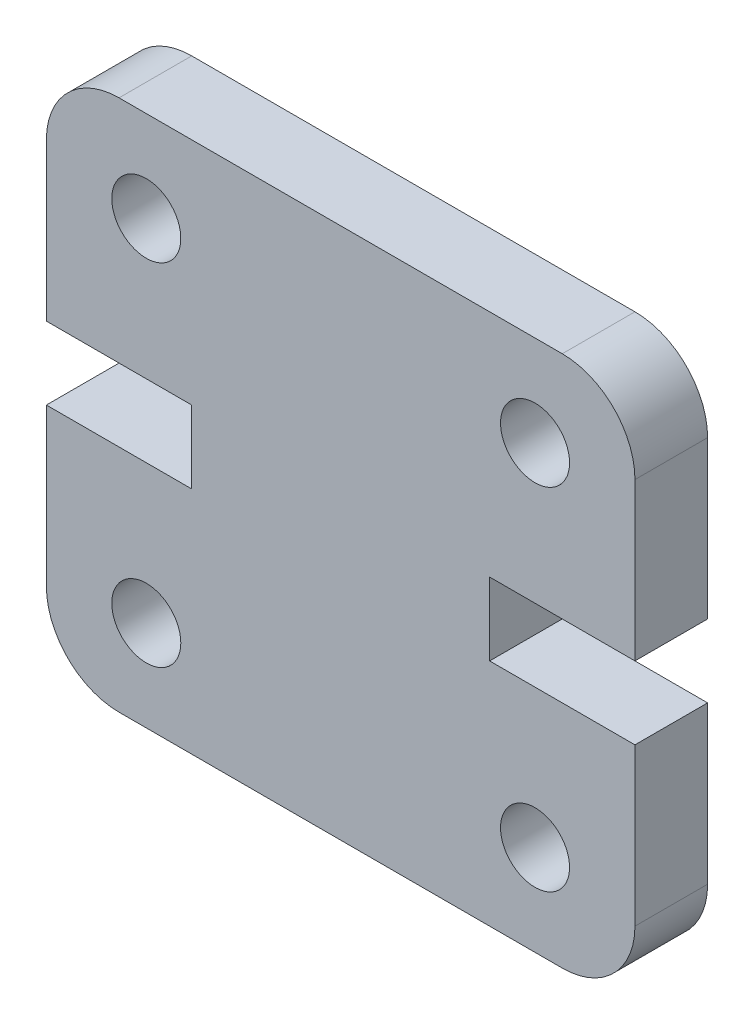
ISO-10303-21;
HEADER;
FILE_DESCRIPTION(('STEP AP214'),'2;1');
FILE_NAME('part.step','',(''),(''),'','','');
FILE_SCHEMA(('AUTOMOTIVE_DESIGN { 1 0 10303 214 1 1 1 1 }'));
ENDSEC;
DATA;
#1=APPLICATION_CONTEXT('core data for automotive mechanical design processes');
#2=APPLICATION_PROTOCOL_DEFINITION('international standard','automotive_design',2000,#1);
#3=PRODUCT_CONTEXT('',#1,'mechanical');
#4=PRODUCT('Part','Part','',(#3));
#5=PRODUCT_RELATED_PRODUCT_CATEGORY('part','',(#4));
#6=PRODUCT_DEFINITION_FORMATION('','',#4);
#7=PRODUCT_DEFINITION_CONTEXT('part definition',#1,'design');
#8=PRODUCT_DEFINITION('design','',#6,#7);
#9=PRODUCT_DEFINITION_SHAPE('','',#8);
#10=(LENGTH_UNIT() NAMED_UNIT(*) SI_UNIT(.MILLI.,.METRE.));
#11=(NAMED_UNIT(*) PLANE_ANGLE_UNIT() SI_UNIT($,.RADIAN.));
#12=(NAMED_UNIT(*) SI_UNIT($,.STERADIAN.) SOLID_ANGLE_UNIT());
#13=UNCERTAINTY_MEASURE_WITH_UNIT(LENGTH_MEASURE(1.E-05),#10,'distance_accuracy_value','');
#14=(GEOMETRIC_REPRESENTATION_CONTEXT(3) GLOBAL_UNCERTAINTY_ASSIGNED_CONTEXT((#13)) GLOBAL_UNIT_ASSIGNED_CONTEXT((#10,
#11,#12)) REPRESENTATION_CONTEXT('',''));
#15=CARTESIAN_POINT('',(0.,0.,0.));
#16=DIRECTION('',(0.,0.,1.));
#17=DIRECTION('',(1.,0.,0.));
#18=AXIS2_PLACEMENT_3D('',#15,#16,#17);
#19=CARTESIAN_POINT('',(2.,12.645,4.));
#20=DIRECTION('',(0.,0.,-1.));
#21=DIRECTION('',(-1.,0.,0.));
#22=AXIS2_PLACEMENT_3D('',#19,#20,#21);
#23=PLANE('',#22);
#24=CARTESIAN_POINT('',(13.4499999999986,12.1450000000001,4.));
#25=DIRECTION('',(0.,0.,1.));
#26=DIRECTION('',(1.,0.,0.));
#27=AXIS2_PLACEMENT_3D('',#24,#25,#26);
#28=CIRCLE('',#27,0.949999999999999);
#29=CARTESIAN_POINT('',(14.3999999999986,12.1450000000001,4.));
#30=VERTEX_POINT('',#29);
#31=EDGE_CURVE('E239',#30,#30,#28,.T.);
#32=ORIENTED_EDGE('',*,*,#31,.F.);
#33=EDGE_LOOP('',(#32));
#34=FACE_BOUND('',#33,.T.);
#35=CARTESIAN_POINT('',(2.75000000000139,12.1450000000001,4.));
#36=DIRECTION('',(0.,0.,1.));
#37=DIRECTION('',(-1.,0.,0.));
#38=AXIS2_PLACEMENT_3D('',#35,#36,#37);
#39=CIRCLE('',#38,0.95);
#40=CARTESIAN_POINT('',(1.80000000000139,12.1450000000001,4.));
#41=VERTEX_POINT('',#40);
#42=EDGE_CURVE('E245',#41,#41,#39,.T.);
#43=ORIENTED_EDGE('',*,*,#42,.F.);
#44=EDGE_LOOP('',(#43));
#45=FACE_BOUND('',#44,.T.);
#46=CARTESIAN_POINT('',(2.,12.645,4.));
#47=DIRECTION('',(0.,0.,1.));
#48=DIRECTION('',(-1.,0.,0.));
#49=AXIS2_PLACEMENT_3D('',#46,#47,#48);
#50=CIRCLE('',#49,2.);
#51=CARTESIAN_POINT('',(2.,14.645,4.));
#52=VERTEX_POINT('',#51);
#53=CARTESIAN_POINT('',(0.,12.645,4.));
#54=VERTEX_POINT('',#53);
#55=EDGE_CURVE('E248',#52,#54,#50,.T.);
#56=ORIENTED_EDGE('',*,*,#55,.T.);
#57=DIRECTION('',(0.,-1.,0.));
#58=VECTOR('',#57,1.);
#59=CARTESIAN_POINT('',(0.,8.3225,4.));
#60=LINE('',#59,#58);
#61=CARTESIAN_POINT('',(0.,8.3225,4.));
#62=VERTEX_POINT('',#61);
#63=EDGE_CURVE('E199',#54,#62,#60,.T.);
#64=ORIENTED_EDGE('',*,*,#63,.T.);
#65=DIRECTION('',(1.,0.,0.));
#66=VECTOR('',#65,1.);
#67=CARTESIAN_POINT('',(0.,8.3225,4.));
#68=LINE('',#67,#66);
#69=CARTESIAN_POINT('',(4.,8.3225,4.));
#70=VERTEX_POINT('',#69);
#71=EDGE_CURVE('E195',#62,#70,#68,.T.);
#72=ORIENTED_EDGE('',*,*,#71,.T.);
#73=DIRECTION('',(0.,-1.,0.));
#74=VECTOR('',#73,1.);
#75=CARTESIAN_POINT('',(4.,6.3225,4.));
#76=LINE('',#75,#74);
#77=CARTESIAN_POINT('',(4.,6.3225,4.));
#78=VERTEX_POINT('',#77);
#79=EDGE_CURVE('E252',#70,#78,#76,.T.);
#80=ORIENTED_EDGE('',*,*,#79,.T.);
#81=DIRECTION('',(-1.,0.,0.));
#82=VECTOR('',#81,1.);
#83=CARTESIAN_POINT('',(0.,6.3225,4.));
#84=LINE('',#83,#82);
#85=CARTESIAN_POINT('',(0.,6.3225,4.));
#86=VERTEX_POINT('',#85);
#87=EDGE_CURVE('E254',#78,#86,#84,.T.);
#88=ORIENTED_EDGE('',*,*,#87,.T.);
#89=DIRECTION('',(0.,-1.,0.));
#90=VECTOR('',#89,1.);
#91=CARTESIAN_POINT('',(0.,6.3225,4.));
#92=LINE('',#91,#90);
#93=CARTESIAN_POINT('',(0.,2.00000000000003,4.));
#94=VERTEX_POINT('',#93);
#95=EDGE_CURVE('E256',#86,#94,#92,.T.);
#96=ORIENTED_EDGE('',*,*,#95,.T.);
#97=CARTESIAN_POINT('',(2.,2.,4.));
#98=DIRECTION('',(0.,0.,1.));
#99=DIRECTION('',(1.,0.,0.));
#100=AXIS2_PLACEMENT_3D('',#97,#98,#99);
#101=CIRCLE('',#100,2.);
#102=CARTESIAN_POINT('',(2.,0.,4.));
#103=VERTEX_POINT('',#102);
#104=EDGE_CURVE('E173',#94,#103,#101,.T.);
#105=ORIENTED_EDGE('',*,*,#104,.T.);
#106=DIRECTION('',(1.,0.,0.));
#107=VECTOR('',#106,1.);
#108=CARTESIAN_POINT('',(2.,0.,4.));
#109=LINE('',#108,#107);
#110=CARTESIAN_POINT('',(14.2,0.,4.));
#111=VERTEX_POINT('',#110);
#112=EDGE_CURVE('E259',#103,#111,#109,.T.);
#113=ORIENTED_EDGE('',*,*,#112,.T.);
#114=CARTESIAN_POINT('',(14.2,2.,4.));
#115=DIRECTION('',(0.,0.,1.));
#116=DIRECTION('',(-1.,0.,0.));
#117=AXIS2_PLACEMENT_3D('',#114,#115,#116);
#118=CIRCLE('',#117,2.);
#119=CARTESIAN_POINT('',(16.2,2.00000000000003,4.));
#120=VERTEX_POINT('',#119);
#121=EDGE_CURVE('E261',#111,#120,#118,.T.);
#122=ORIENTED_EDGE('',*,*,#121,.T.);
#123=DIRECTION('',(0.,1.,0.));
#124=VECTOR('',#123,1.);
#125=CARTESIAN_POINT('',(16.2,6.3225,4.));
#126=LINE('',#125,#124);
#127=CARTESIAN_POINT('',(16.2,6.3225,4.));
#128=VERTEX_POINT('',#127);
#129=EDGE_CURVE('E263',#120,#128,#126,.T.);
#130=ORIENTED_EDGE('',*,*,#129,.T.);
#131=DIRECTION('',(-1.,0.,0.));
#132=VECTOR('',#131,1.);
#133=CARTESIAN_POINT('',(16.2,6.3225,4.));
#134=LINE('',#133,#132);
#135=CARTESIAN_POINT('',(12.2,6.3225,4.));
#136=VERTEX_POINT('',#135);
#137=EDGE_CURVE('E265',#128,#136,#134,.T.);
#138=ORIENTED_EDGE('',*,*,#137,.T.);
#139=DIRECTION('',(0.,1.,0.));
#140=VECTOR('',#139,1.);
#141=CARTESIAN_POINT('',(12.2,6.3225,4.));
#142=LINE('',#141,#140);
#143=CARTESIAN_POINT('',(12.2,8.3225,4.));
#144=VERTEX_POINT('',#143);
#145=EDGE_CURVE('E267',#136,#144,#142,.T.);
#146=ORIENTED_EDGE('',*,*,#145,.T.);
#147=DIRECTION('',(1.,0.,0.));
#148=VECTOR('',#147,1.);
#149=CARTESIAN_POINT('',(16.2,8.3225,4.));
#150=LINE('',#149,#148);
#151=CARTESIAN_POINT('',(16.2,8.3225,4.));
#152=VERTEX_POINT('',#151);
#153=EDGE_CURVE('E269',#144,#152,#150,.T.);
#154=ORIENTED_EDGE('',*,*,#153,.T.);
#155=DIRECTION('',(0.,1.,0.));
#156=VECTOR('',#155,1.);
#157=CARTESIAN_POINT('',(16.2,8.3225,4.));
#158=LINE('',#157,#156);
#159=CARTESIAN_POINT('',(16.2,12.645,4.));
#160=VERTEX_POINT('',#159);
#161=EDGE_CURVE('E271',#152,#160,#158,.T.);
#162=ORIENTED_EDGE('',*,*,#161,.T.);
#163=CARTESIAN_POINT('',(14.2,12.645,4.));
#164=DIRECTION('',(0.,0.,1.));
#165=DIRECTION('',(1.,0.,0.));
#166=AXIS2_PLACEMENT_3D('',#163,#164,#165);
#167=CIRCLE('',#166,2.);
#168=CARTESIAN_POINT('',(14.2,14.645,4.));
#169=VERTEX_POINT('',#168);
#170=EDGE_CURVE('E273',#160,#169,#167,.T.);
#171=ORIENTED_EDGE('',*,*,#170,.T.);
#172=DIRECTION('',(-1.,0.,0.));
#173=VECTOR('',#172,1.);
#174=CARTESIAN_POINT('',(2.,14.645,4.));
#175=LINE('',#174,#173);
#176=EDGE_CURVE('E57',#169,#52,#175,.T.);
#177=ORIENTED_EDGE('',*,*,#176,.T.);
#178=EDGE_LOOP('',(#56,#64,#72,#80,#88,#96,#105,#113,#122,#130,#138,#146,#154,#162,#171,#177));
#179=FACE_BOUND('',#178,.T.);
#180=CARTESIAN_POINT('',(13.4499999999986,2.4999999999999,4.));
#181=DIRECTION('',(0.,0.,1.));
#182=DIRECTION('',(-1.,0.,0.));
#183=AXIS2_PLACEMENT_3D('',#180,#181,#182);
#184=CIRCLE('',#183,0.949999999999999);
#185=CARTESIAN_POINT('',(12.4999999999986,2.4999999999999,4.));
#186=VERTEX_POINT('',#185);
#187=EDGE_CURVE('E242',#186,#186,#184,.T.);
#188=ORIENTED_EDGE('',*,*,#187,.F.);
#189=EDGE_LOOP('',(#188));
#190=FACE_BOUND('',#189,.T.);
#191=CARTESIAN_POINT('',(2.75000000000139,2.4999999999999,4.));
#192=DIRECTION('',(0.,0.,1.));
#193=DIRECTION('',(1.,0.,0.));
#194=AXIS2_PLACEMENT_3D('',#191,#192,#193);
#195=CIRCLE('',#194,0.95);
#196=CARTESIAN_POINT('',(3.70000000000139,2.4999999999999,4.));
#197=VERTEX_POINT('',#196);
#198=EDGE_CURVE('E236',#197,#197,#195,.T.);
#199=ORIENTED_EDGE('',*,*,#198,.F.);
#200=EDGE_LOOP('',(#199));
#201=FACE_BOUND('',#200,.T.);
#202=ADVANCED_FACE('F33',(#34,#45,#179,#190,#201),#23,.F.);
#203=CARTESIAN_POINT('',(2.,12.645,4.));
#204=DIRECTION('',(0.,0.,-1.));
#205=DIRECTION('',(-1.,0.,0.));
#206=AXIS2_PLACEMENT_3D('',#203,#204,#205);
#207=CYLINDRICAL_SURFACE('',#206,2.);
#208=DIRECTION('',(0.,0.,-1.));
#209=VECTOR('',#208,1.);
#210=CARTESIAN_POINT('',(2.,14.645,4.));
#211=LINE('',#210,#209);
#212=CARTESIAN_POINT('',(2.,14.645,2.));
#213=VERTEX_POINT('',#212);
#214=EDGE_CURVE('E276',#52,#213,#211,.T.);
#215=ORIENTED_EDGE('',*,*,#214,.T.);
#216=CARTESIAN_POINT('',(2.,12.645,2.));
#217=DIRECTION('',(0.,0.,1.));
#218=DIRECTION('',(1.,0.,0.));
#219=AXIS2_PLACEMENT_3D('',#216,#217,#218);
#220=CIRCLE('',#219,2.);
#221=CARTESIAN_POINT('',(0.,12.645,2.));
#222=VERTEX_POINT('',#221);
#223=EDGE_CURVE('E49',#213,#222,#220,.T.);
#224=ORIENTED_EDGE('',*,*,#223,.T.);
#225=DIRECTION('',(0.,0.,-1.));
#226=VECTOR('',#225,1.);
#227=CARTESIAN_POINT('',(0.,12.645,4.));
#228=LINE('',#227,#226);
#229=EDGE_CURVE('E11',#54,#222,#228,.T.);
#230=ORIENTED_EDGE('',*,*,#229,.F.);
#231=ORIENTED_EDGE('',*,*,#55,.F.);
#232=EDGE_LOOP('',(#215,#224,#230,#231));
#233=FACE_BOUND('',#232,.T.);
#234=ADVANCED_FACE('F35',(#233),#207,.T.);
#235=CARTESIAN_POINT('',(0.,8.3225,4.));
#236=DIRECTION('',(1.,0.,0.));
#237=DIRECTION('',(0.,1.,0.));
#238=AXIS2_PLACEMENT_3D('',#235,#236,#237);
#239=PLANE('',#238);
#240=ORIENTED_EDGE('',*,*,#229,.T.);
#241=DIRECTION('',(0.,1.,0.));
#242=VECTOR('',#241,1.);
#243=CARTESIAN_POINT('',(0.,14.645,2.));
#244=LINE('',#243,#242);
#245=CARTESIAN_POINT('',(0.,8.3225,2.));
#246=VERTEX_POINT('',#245);
#247=EDGE_CURVE('E170',#246,#222,#244,.T.);
#248=ORIENTED_EDGE('',*,*,#247,.F.);
#249=DIRECTION('',(0.,0.,-1.));
#250=VECTOR('',#249,1.);
#251=CARTESIAN_POINT('',(0.,8.3225,4.));
#252=LINE('',#251,#250);
#253=EDGE_CURVE('E42',#62,#246,#252,.T.);
#254=ORIENTED_EDGE('',*,*,#253,.F.);
#255=ORIENTED_EDGE('',*,*,#63,.F.);
#256=EDGE_LOOP('',(#240,#248,#254,#255));
#257=FACE_BOUND('',#256,.T.);
#258=ADVANCED_FACE('F198',(#257),#239,.F.);
#259=CARTESIAN_POINT('',(0.,8.3225,4.));
#260=DIRECTION('',(0.,1.,0.));
#261=DIRECTION('',(0.,0.,1.));
#262=AXIS2_PLACEMENT_3D('',#259,#260,#261);
#263=PLANE('',#262);
#264=ORIENTED_EDGE('',*,*,#253,.T.);
#265=DIRECTION('',(1.,0.,0.));
#266=VECTOR('',#265,1.);
#267=CARTESIAN_POINT('',(0.,8.3225,2.));
#268=LINE('',#267,#266);
#269=CARTESIAN_POINT('',(4.,8.3225,2.));
#270=VERTEX_POINT('',#269);
#271=EDGE_CURVE('E194',#246,#270,#268,.T.);
#272=ORIENTED_EDGE('',*,*,#271,.T.);
#273=DIRECTION('',(0.,0.,-1.));
#274=VECTOR('',#273,1.);
#275=CARTESIAN_POINT('',(4.,8.3225,4.));
#276=LINE('',#275,#274);
#277=EDGE_CURVE('E184',#70,#270,#276,.T.);
#278=ORIENTED_EDGE('',*,*,#277,.F.);
#279=ORIENTED_EDGE('',*,*,#71,.F.);
#280=EDGE_LOOP('',(#264,#272,#278,#279));
#281=FACE_BOUND('',#280,.T.);
#282=ADVANCED_FACE('F192',(#281),#263,.F.);
#283=CARTESIAN_POINT('',(4.,6.3225,4.));
#284=DIRECTION('',(1.,0.,0.));
#285=DIRECTION('',(0.,0.,-1.));
#286=AXIS2_PLACEMENT_3D('',#283,#284,#285);
#287=PLANE('',#286);
#288=ORIENTED_EDGE('',*,*,#277,.T.);
#289=DIRECTION('',(0.,-1.,0.));
#290=VECTOR('',#289,1.);
#291=CARTESIAN_POINT('',(4.,6.3225,2.));
#292=LINE('',#291,#290);
#293=CARTESIAN_POINT('',(4.,6.3225,2.));
#294=VERTEX_POINT('',#293);
#295=EDGE_CURVE('E231',#270,#294,#292,.T.);
#296=ORIENTED_EDGE('',*,*,#295,.T.);
#297=DIRECTION('',(0.,0.,-1.));
#298=VECTOR('',#297,1.);
#299=CARTESIAN_POINT('',(4.,6.3225,4.));
#300=LINE('',#299,#298);
#301=EDGE_CURVE('E176',#78,#294,#300,.T.);
#302=ORIENTED_EDGE('',*,*,#301,.F.);
#303=ORIENTED_EDGE('',*,*,#79,.F.);
#304=EDGE_LOOP('',(#288,#296,#302,#303));
#305=FACE_BOUND('',#304,.T.);
#306=ADVANCED_FACE('F315',(#305),#287,.F.);
#307=CARTESIAN_POINT('',(0.,6.3225,4.));
#308=DIRECTION('',(0.,-1.,0.));
#309=DIRECTION('',(0.,0.,-1.));
#310=AXIS2_PLACEMENT_3D('',#307,#308,#309);
#311=PLANE('',#310);
#312=ORIENTED_EDGE('',*,*,#301,.T.);
#313=DIRECTION('',(-1.,0.,0.));
#314=VECTOR('',#313,1.);
#315=CARTESIAN_POINT('',(0.,6.3225,2.));
#316=LINE('',#315,#314);
#317=CARTESIAN_POINT('',(0.,6.3225,2.));
#318=VERTEX_POINT('',#317);
#319=EDGE_CURVE('E157',#294,#318,#316,.T.);
#320=ORIENTED_EDGE('',*,*,#319,.T.);
#321=DIRECTION('',(0.,0.,-1.));
#322=VECTOR('',#321,1.);
#323=CARTESIAN_POINT('',(0.,6.3225,4.));
#324=LINE('',#323,#322);
#325=EDGE_CURVE('E168',#86,#318,#324,.T.);
#326=ORIENTED_EDGE('',*,*,#325,.F.);
#327=ORIENTED_EDGE('',*,*,#87,.F.);
#328=EDGE_LOOP('',(#312,#320,#326,#327));
#329=FACE_BOUND('',#328,.T.);
#330=ADVANCED_FACE('F313',(#329),#311,.F.);
#331=CARTESIAN_POINT('',(0.,6.3225,4.));
#332=DIRECTION('',(1.,0.,0.));
#333=DIRECTION('',(0.,1.,0.));
#334=AXIS2_PLACEMENT_3D('',#331,#332,#333);
#335=PLANE('',#334);
#336=ORIENTED_EDGE('',*,*,#325,.T.);
#337=CARTESIAN_POINT('',(0.,2.,2.));
#338=VERTEX_POINT('',#337);
#339=EDGE_CURVE('E149',#338,#318,#244,.T.);
#340=ORIENTED_EDGE('',*,*,#339,.F.);
#341=DIRECTION('',(0.,0.,-1.));
#342=VECTOR('',#341,1.);
#343=CARTESIAN_POINT('',(0.,2.00000000000003,4.));
#344=LINE('',#343,#342);
#345=EDGE_CURVE('E165',#94,#338,#344,.T.);
#346=ORIENTED_EDGE('',*,*,#345,.F.);
#347=ORIENTED_EDGE('',*,*,#95,.F.);
#348=EDGE_LOOP('',(#336,#340,#346,#347));
#349=FACE_BOUND('',#348,.T.);
#350=ADVANCED_FACE('F163',(#349),#335,.F.);
#351=CARTESIAN_POINT('',(2.,2.,4.));
#352=DIRECTION('',(0.,0.,-1.));
#353=DIRECTION('',(-1.,0.,0.));
#354=AXIS2_PLACEMENT_3D('',#351,#352,#353);
#355=CYLINDRICAL_SURFACE('',#354,2.);
#356=ORIENTED_EDGE('',*,*,#345,.T.);
#357=CARTESIAN_POINT('',(2.,2.,2.));
#358=DIRECTION('',(0.,0.,1.));
#359=DIRECTION('',(1.,0.,0.));
#360=AXIS2_PLACEMENT_3D('',#357,#358,#359);
#361=CIRCLE('',#360,2.);
#362=CARTESIAN_POINT('',(2.,0.,2.));
#363=VERTEX_POINT('',#362);
#364=EDGE_CURVE('E146',#338,#363,#361,.T.);
#365=ORIENTED_EDGE('',*,*,#364,.T.);
#366=DIRECTION('',(0.,0.,-1.));
#367=VECTOR('',#366,1.);
#368=CARTESIAN_POINT('',(2.,0.,4.));
#369=LINE('',#368,#367);
#370=EDGE_CURVE('E174',#103,#363,#369,.T.);
#371=ORIENTED_EDGE('',*,*,#370,.F.);
#372=ORIENTED_EDGE('',*,*,#104,.F.);
#373=EDGE_LOOP('',(#356,#365,#371,#372));
#374=FACE_BOUND('',#373,.T.);
#375=ADVANCED_FACE('F172',(#374),#355,.T.);
#376=CARTESIAN_POINT('',(2.,0.,4.));
#377=DIRECTION('',(0.,1.,0.));
#378=DIRECTION('',(-1.,0.,0.));
#379=AXIS2_PLACEMENT_3D('',#376,#377,#378);
#380=PLANE('',#379);
#381=ORIENTED_EDGE('',*,*,#370,.T.);
#382=DIRECTION('',(-1.,0.,0.));
#383=VECTOR('',#382,1.);
#384=CARTESIAN_POINT('',(0.,0.,2.));
#385=LINE('',#384,#383);
#386=CARTESIAN_POINT('',(14.2,0.,2.));
#387=VERTEX_POINT('',#386);
#388=EDGE_CURVE('E152',#387,#363,#385,.T.);
#389=ORIENTED_EDGE('',*,*,#388,.F.);
#390=DIRECTION('',(0.,0.,-1.));
#391=VECTOR('',#390,1.);
#392=CARTESIAN_POINT('',(14.2,0.,4.));
#393=LINE('',#392,#391);
#394=EDGE_CURVE('E178',#111,#387,#393,.T.);
#395=ORIENTED_EDGE('',*,*,#394,.F.);
#396=ORIENTED_EDGE('',*,*,#112,.F.);
#397=EDGE_LOOP('',(#381,#389,#395,#396));
#398=FACE_BOUND('',#397,.T.);
#399=ADVANCED_FACE('F307',(#398),#380,.F.);
#400=CARTESIAN_POINT('',(14.2,2.,4.));
#401=DIRECTION('',(0.,0.,-1.));
#402=DIRECTION('',(-1.,0.,0.));
#403=AXIS2_PLACEMENT_3D('',#400,#401,#402);
#404=CYLINDRICAL_SURFACE('',#403,2.);
#405=ORIENTED_EDGE('',*,*,#394,.T.);
#406=CARTESIAN_POINT('',(14.2,2.,2.));
#407=DIRECTION('',(0.,0.,1.));
#408=DIRECTION('',(1.,0.,0.));
#409=AXIS2_PLACEMENT_3D('',#406,#407,#408);
#410=CIRCLE('',#409,2.);
#411=CARTESIAN_POINT('',(16.2,2.00000000000003,2.));
#412=VERTEX_POINT('',#411);
#413=EDGE_CURVE('E158',#387,#412,#410,.T.);
#414=ORIENTED_EDGE('',*,*,#413,.T.);
#415=DIRECTION('',(0.,0.,-1.));
#416=VECTOR('',#415,1.);
#417=CARTESIAN_POINT('',(16.2,2.00000000000003,4.));
#418=LINE('',#417,#416);
#419=EDGE_CURVE('E297',#120,#412,#418,.T.);
#420=ORIENTED_EDGE('',*,*,#419,.F.);
#421=ORIENTED_EDGE('',*,*,#121,.F.);
#422=EDGE_LOOP('',(#405,#414,#420,#421));
#423=FACE_BOUND('',#422,.T.);
#424=ADVANCED_FACE('F303',(#423),#404,.T.);
#425=CARTESIAN_POINT('',(16.2,6.3225,4.));
#426=DIRECTION('',(-1.,0.,0.));
#427=DIRECTION('',(0.,-1.,0.));
#428=AXIS2_PLACEMENT_3D('',#425,#426,#427);
#429=PLANE('',#428);
#430=ORIENTED_EDGE('',*,*,#419,.T.);
#431=DIRECTION('',(0.,-1.,0.));
#432=VECTOR('',#431,1.);
#433=CARTESIAN_POINT('',(16.2,0.,2.));
#434=LINE('',#433,#432);
#435=CARTESIAN_POINT('',(16.2,6.3225,2.));
#436=VERTEX_POINT('',#435);
#437=EDGE_CURVE('E203',#436,#412,#434,.T.);
#438=ORIENTED_EDGE('',*,*,#437,.F.);
#439=DIRECTION('',(0.,0.,-1.));
#440=VECTOR('',#439,1.);
#441=CARTESIAN_POINT('',(16.2,6.3225,4.));
#442=LINE('',#441,#440);
#443=EDGE_CURVE('E294',#128,#436,#442,.T.);
#444=ORIENTED_EDGE('',*,*,#443,.F.);
#445=ORIENTED_EDGE('',*,*,#129,.F.);
#446=EDGE_LOOP('',(#430,#438,#444,#445));
#447=FACE_BOUND('',#446,.T.);
#448=ADVANCED_FACE('F360',(#447),#429,.F.);
#449=CARTESIAN_POINT('',(16.2,6.3225,4.));
#450=DIRECTION('',(0.,-1.,0.));
#451=DIRECTION('',(0.,0.,-1.));
#452=AXIS2_PLACEMENT_3D('',#449,#450,#451);
#453=PLANE('',#452);
#454=ORIENTED_EDGE('',*,*,#443,.T.);
#455=DIRECTION('',(-1.,0.,0.));
#456=VECTOR('',#455,1.);
#457=CARTESIAN_POINT('',(16.2,6.3225,2.));
#458=LINE('',#457,#456);
#459=CARTESIAN_POINT('',(12.2,6.3225,2.));
#460=VERTEX_POINT('',#459);
#461=EDGE_CURVE('E225',#436,#460,#458,.T.);
#462=ORIENTED_EDGE('',*,*,#461,.T.);
#463=DIRECTION('',(0.,0.,-1.));
#464=VECTOR('',#463,1.);
#465=CARTESIAN_POINT('',(12.2,6.3225,4.));
#466=LINE('',#465,#464);
#467=EDGE_CURVE('E291',#136,#460,#466,.T.);
#468=ORIENTED_EDGE('',*,*,#467,.F.);
#469=ORIENTED_EDGE('',*,*,#137,.F.);
#470=EDGE_LOOP('',(#454,#462,#468,#469));
#471=FACE_BOUND('',#470,.T.);
#472=ADVANCED_FACE('F356',(#471),#453,.F.);
#473=CARTESIAN_POINT('',(12.2,6.3225,4.));
#474=DIRECTION('',(-1.,0.,0.));
#475=DIRECTION('',(0.,0.,1.));
#476=AXIS2_PLACEMENT_3D('',#473,#474,#475);
#477=PLANE('',#476);
#478=ORIENTED_EDGE('',*,*,#467,.T.);
#479=DIRECTION('',(0.,1.,0.));
#480=VECTOR('',#479,1.);
#481=CARTESIAN_POINT('',(12.2,6.3225,2.));
#482=LINE('',#481,#480);
#483=CARTESIAN_POINT('',(12.2,8.3225,2.));
#484=VERTEX_POINT('',#483);
#485=EDGE_CURVE('E222',#460,#484,#482,.T.);
#486=ORIENTED_EDGE('',*,*,#485,.T.);
#487=DIRECTION('',(0.,0.,-1.));
#488=VECTOR('',#487,1.);
#489=CARTESIAN_POINT('',(12.2,8.3225,4.));
#490=LINE('',#489,#488);
#491=EDGE_CURVE('E288',#144,#484,#490,.T.);
#492=ORIENTED_EDGE('',*,*,#491,.F.);
#493=ORIENTED_EDGE('',*,*,#145,.F.);
#494=EDGE_LOOP('',(#478,#486,#492,#493));
#495=FACE_BOUND('',#494,.T.);
#496=ADVANCED_FACE('F352',(#495),#477,.F.);
#497=CARTESIAN_POINT('',(16.2,8.3225,4.));
#498=DIRECTION('',(0.,1.,0.));
#499=DIRECTION('',(0.,0.,1.));
#500=AXIS2_PLACEMENT_3D('',#497,#498,#499);
#501=PLANE('',#500);
#502=ORIENTED_EDGE('',*,*,#491,.T.);
#503=DIRECTION('',(1.,0.,0.));
#504=VECTOR('',#503,1.);
#505=CARTESIAN_POINT('',(16.2,8.3225,2.));
#506=LINE('',#505,#504);
#507=CARTESIAN_POINT('',(16.2,8.3225,2.));
#508=VERTEX_POINT('',#507);
#509=EDGE_CURVE('E219',#484,#508,#506,.T.);
#510=ORIENTED_EDGE('',*,*,#509,.T.);
#511=DIRECTION('',(0.,0.,-1.));
#512=VECTOR('',#511,1.);
#513=CARTESIAN_POINT('',(16.2,8.3225,4.));
#514=LINE('',#513,#512);
#515=EDGE_CURVE('E285',#152,#508,#514,.T.);
#516=ORIENTED_EDGE('',*,*,#515,.F.);
#517=ORIENTED_EDGE('',*,*,#153,.F.);
#518=EDGE_LOOP('',(#502,#510,#516,#517));
#519=FACE_BOUND('',#518,.T.);
#520=ADVANCED_FACE('F348',(#519),#501,.F.);
#521=CARTESIAN_POINT('',(16.2,8.3225,4.));
#522=DIRECTION('',(-1.,0.,0.));
#523=DIRECTION('',(0.,-1.,0.));
#524=AXIS2_PLACEMENT_3D('',#521,#522,#523);
#525=PLANE('',#524);
#526=ORIENTED_EDGE('',*,*,#515,.T.);
#527=CARTESIAN_POINT('',(16.2,12.645,2.));
#528=VERTEX_POINT('',#527);
#529=EDGE_CURVE('E205',#528,#508,#434,.T.);
#530=ORIENTED_EDGE('',*,*,#529,.F.);
#531=DIRECTION('',(0.,0.,-1.));
#532=VECTOR('',#531,1.);
#533=CARTESIAN_POINT('',(16.2,12.645,4.));
#534=LINE('',#533,#532);
#535=EDGE_CURVE('E282',#160,#528,#534,.T.);
#536=ORIENTED_EDGE('',*,*,#535,.F.);
#537=ORIENTED_EDGE('',*,*,#161,.F.);
#538=EDGE_LOOP('',(#526,#530,#536,#537));
#539=FACE_BOUND('',#538,.T.);
#540=ADVANCED_FACE('F344',(#539),#525,.F.);
#541=CARTESIAN_POINT('',(14.2,12.645,4.));
#542=DIRECTION('',(0.,0.,-1.));
#543=DIRECTION('',(-1.,0.,0.));
#544=AXIS2_PLACEMENT_3D('',#541,#542,#543);
#545=CYLINDRICAL_SURFACE('',#544,2.);
#546=ORIENTED_EDGE('',*,*,#535,.T.);
#547=CARTESIAN_POINT('',(14.2,12.645,2.));
#548=DIRECTION('',(0.,0.,1.));
#549=DIRECTION('',(1.,0.,0.));
#550=AXIS2_PLACEMENT_3D('',#547,#548,#549);
#551=CIRCLE('',#550,2.);
#552=CARTESIAN_POINT('',(14.2,14.645,2.));
#553=VERTEX_POINT('',#552);
#554=EDGE_CURVE('E216',#528,#553,#551,.T.);
#555=ORIENTED_EDGE('',*,*,#554,.T.);
#556=DIRECTION('',(0.,0.,-1.));
#557=VECTOR('',#556,1.);
#558=CARTESIAN_POINT('',(14.2,14.645,4.));
#559=LINE('',#558,#557);
#560=EDGE_CURVE('E279',#169,#553,#559,.T.);
#561=ORIENTED_EDGE('',*,*,#560,.F.);
#562=ORIENTED_EDGE('',*,*,#170,.F.);
#563=EDGE_LOOP('',(#546,#555,#561,#562));
#564=FACE_BOUND('',#563,.T.);
#565=ADVANCED_FACE('F340',(#564),#545,.T.);
#566=CARTESIAN_POINT('',(2.,14.645,4.));
#567=DIRECTION('',(0.,-1.,0.));
#568=DIRECTION('',(1.,0.,0.));
#569=AXIS2_PLACEMENT_3D('',#566,#567,#568);
#570=PLANE('',#569);
#571=ORIENTED_EDGE('',*,*,#560,.T.);
#572=DIRECTION('',(1.,0.,0.));
#573=VECTOR('',#572,1.);
#574=CARTESIAN_POINT('',(16.2,14.645,2.));
#575=LINE('',#574,#573);
#576=EDGE_CURVE('E169',#213,#553,#575,.T.);
#577=ORIENTED_EDGE('',*,*,#576,.F.);
#578=ORIENTED_EDGE('',*,*,#214,.F.);
#579=ORIENTED_EDGE('',*,*,#176,.F.);
#580=EDGE_LOOP('',(#571,#577,#578,#579));
#581=FACE_BOUND('',#580,.T.);
#582=ADVANCED_FACE('F337',(#581),#570,.F.);
#583=CARTESIAN_POINT('',(2.75000000000139,12.1450000000001,4.));
#584=DIRECTION('',(0.,0.,-1.));
#585=DIRECTION('',(-1.,0.,0.));
#586=AXIS2_PLACEMENT_3D('',#583,#584,#585);
#587=CYLINDRICAL_SURFACE('',#586,0.95);
#588=CARTESIAN_POINT('',(2.75000000000139,12.1450000000001,2.));
#589=DIRECTION('',(0.,0.,1.));
#590=DIRECTION('',(1.,0.,0.));
#591=AXIS2_PLACEMENT_3D('',#588,#589,#590);
#592=CIRCLE('',#591,0.95);
#593=CARTESIAN_POINT('',(3.70000000000139,12.1450000000001,2.));
#594=VERTEX_POINT('',#593);
#595=EDGE_CURVE('E213',#594,#594,#592,.T.);
#596=ORIENTED_EDGE('',*,*,#595,.F.);
#597=EDGE_LOOP('',(#596));
#598=FACE_BOUND('',#597,.T.);
#599=ORIENTED_EDGE('',*,*,#42,.T.);
#600=EDGE_LOOP('',(#599));
#601=FACE_BOUND('',#600,.T.);
#602=ADVANCED_FACE('F335',(#598,#601),#587,.F.);
#603=CARTESIAN_POINT('',(13.4499999999986,2.4999999999999,4.));
#604=DIRECTION('',(0.,0.,-1.));
#605=DIRECTION('',(-1.,0.,0.));
#606=AXIS2_PLACEMENT_3D('',#603,#604,#605);
#607=CYLINDRICAL_SURFACE('',#606,0.949999999999999);
#608=CARTESIAN_POINT('',(13.4499999999986,2.4999999999999,2.));
#609=DIRECTION('',(0.,0.,1.));
#610=DIRECTION('',(1.,0.,0.));
#611=AXIS2_PLACEMENT_3D('',#608,#609,#610);
#612=CIRCLE('',#611,0.949999999999999);
#613=CARTESIAN_POINT('',(14.3999999999986,2.4999999999999,2.));
#614=VERTEX_POINT('',#613);
#615=EDGE_CURVE('E210',#614,#614,#612,.T.);
#616=ORIENTED_EDGE('',*,*,#615,.F.);
#617=EDGE_LOOP('',(#616));
#618=FACE_BOUND('',#617,.T.);
#619=ORIENTED_EDGE('',*,*,#187,.T.);
#620=EDGE_LOOP('',(#619));
#621=FACE_BOUND('',#620,.T.);
#622=ADVANCED_FACE('F422',(#618,#621),#607,.F.);
#623=CARTESIAN_POINT('',(13.4499999999986,12.1450000000001,4.));
#624=DIRECTION('',(0.,0.,-1.));
#625=DIRECTION('',(-1.,0.,0.));
#626=AXIS2_PLACEMENT_3D('',#623,#624,#625);
#627=CYLINDRICAL_SURFACE('',#626,0.949999999999999);
#628=CARTESIAN_POINT('',(13.4499999999986,12.1450000000001,2.));
#629=DIRECTION('',(0.,0.,1.));
#630=DIRECTION('',(1.,0.,0.));
#631=AXIS2_PLACEMENT_3D('',#628,#629,#630);
#632=CIRCLE('',#631,0.949999999999999);
#633=CARTESIAN_POINT('',(14.3999999999986,12.1450000000001,2.));
#634=VERTEX_POINT('',#633);
#635=EDGE_CURVE('E207',#634,#634,#632,.T.);
#636=ORIENTED_EDGE('',*,*,#635,.F.);
#637=EDGE_LOOP('',(#636));
#638=FACE_BOUND('',#637,.T.);
#639=ORIENTED_EDGE('',*,*,#31,.T.);
#640=EDGE_LOOP('',(#639));
#641=FACE_BOUND('',#640,.T.);
#642=ADVANCED_FACE('F429',(#638,#641),#627,.F.);
#643=CARTESIAN_POINT('',(2.75000000000139,2.4999999999999,4.));
#644=DIRECTION('',(0.,0.,-1.));
#645=DIRECTION('',(-1.,0.,0.));
#646=AXIS2_PLACEMENT_3D('',#643,#644,#645);
#647=CYLINDRICAL_SURFACE('',#646,0.95);
#648=CARTESIAN_POINT('',(2.75000000000139,2.4999999999999,2.));
#649=DIRECTION('',(0.,0.,1.));
#650=DIRECTION('',(1.,0.,0.));
#651=AXIS2_PLACEMENT_3D('',#648,#649,#650);
#652=CIRCLE('',#651,0.95);
#653=CARTESIAN_POINT('',(3.70000000000139,2.4999999999999,2.));
#654=VERTEX_POINT('',#653);
#655=EDGE_CURVE('E37',#654,#654,#652,.T.);
#656=ORIENTED_EDGE('',*,*,#655,.F.);
#657=EDGE_LOOP('',(#656));
#658=FACE_BOUND('',#657,.T.);
#659=ORIENTED_EDGE('',*,*,#198,.T.);
#660=EDGE_LOOP('',(#659));
#661=FACE_BOUND('',#660,.T.);
#662=ADVANCED_FACE('F436',(#658,#661),#647,.F.);
#663=CARTESIAN_POINT('',(0.,0.,2.));
#664=DIRECTION('',(0.,0.,1.));
#665=DIRECTION('',(1.,0.,0.));
#666=AXIS2_PLACEMENT_3D('',#663,#664,#665);
#667=PLANE('',#666);
#668=ORIENTED_EDGE('',*,*,#595,.T.);
#669=EDGE_LOOP('',(#668));
#670=FACE_BOUND('',#669,.T.);
#671=ORIENTED_EDGE('',*,*,#615,.T.);
#672=EDGE_LOOP('',(#671));
#673=FACE_BOUND('',#672,.T.);
#674=ORIENTED_EDGE('',*,*,#635,.T.);
#675=EDGE_LOOP('',(#674));
#676=FACE_BOUND('',#675,.T.);
#677=ORIENTED_EDGE('',*,*,#655,.T.);
#678=EDGE_LOOP('',(#677));
#679=FACE_BOUND('',#678,.T.);
#680=ORIENTED_EDGE('',*,*,#576,.T.);
#681=ORIENTED_EDGE('',*,*,#554,.F.);
#682=ORIENTED_EDGE('',*,*,#529,.T.);
#683=ORIENTED_EDGE('',*,*,#509,.F.);
#684=ORIENTED_EDGE('',*,*,#485,.F.);
#685=ORIENTED_EDGE('',*,*,#461,.F.);
#686=ORIENTED_EDGE('',*,*,#437,.T.);
#687=ORIENTED_EDGE('',*,*,#413,.F.);
#688=ORIENTED_EDGE('',*,*,#388,.T.);
#689=ORIENTED_EDGE('',*,*,#364,.F.);
#690=ORIENTED_EDGE('',*,*,#339,.T.);
#691=ORIENTED_EDGE('',*,*,#319,.F.);
#692=ORIENTED_EDGE('',*,*,#295,.F.);
#693=ORIENTED_EDGE('',*,*,#271,.F.);
#694=ORIENTED_EDGE('',*,*,#247,.T.);
#695=ORIENTED_EDGE('',*,*,#223,.F.);
#696=EDGE_LOOP('',(#680,#681,#682,#683,#684,#685,#686,#687,#688,#689,#690,#691,#692,#693,#694,#695));
#697=FACE_BOUND('',#696,.T.);
#698=ADVANCED_FACE('F148',(#670,#673,#676,#679,#697),#667,.F.);
#699=CLOSED_SHELL('',(#202,#234,#258,#282,#306,#330,#350,#375,#399,#424,#448,#472,#496,#520,
#540,#565,#582,#602,#622,#642,#662,#698));
#700=MANIFOLD_SOLID_BREP('B2',#699);
#701=ADVANCED_BREP_SHAPE_REPRESENTATION('',(#18,#700),#14);
#702=SHAPE_DEFINITION_REPRESENTATION(#9,#701);
ENDSEC;
END-ISO-10303-21;
